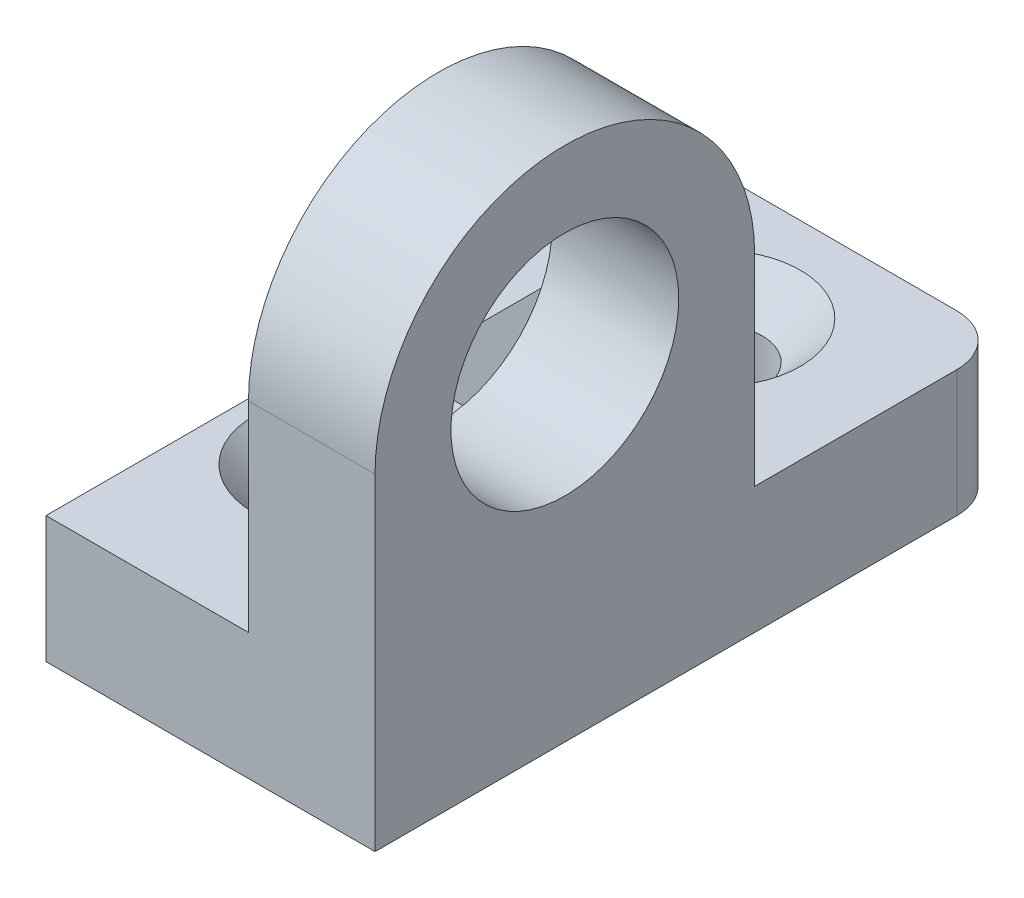
ISO-10303-21;
HEADER;
FILE_DESCRIPTION(('STEP AP214'),'2;1');
FILE_NAME('part.step','',(''),(''),'','','');
FILE_SCHEMA(('AUTOMOTIVE_DESIGN { 1 0 10303 214 1 1 1 1 }'));
ENDSEC;
DATA;
#1=APPLICATION_CONTEXT('core data for automotive mechanical design processes');
#2=APPLICATION_PROTOCOL_DEFINITION('international standard','automotive_design',2000,#1);
#3=PRODUCT_CONTEXT('',#1,'mechanical');
#4=PRODUCT('Part','Part','',(#3));
#5=PRODUCT_RELATED_PRODUCT_CATEGORY('part','',(#4));
#6=PRODUCT_DEFINITION_FORMATION('','',#4);
#7=PRODUCT_DEFINITION_CONTEXT('part definition',#1,'design');
#8=PRODUCT_DEFINITION('design','',#6,#7);
#9=PRODUCT_DEFINITION_SHAPE('','',#8);
#10=(LENGTH_UNIT() NAMED_UNIT(*) SI_UNIT(.MILLI.,.METRE.));
#11=(NAMED_UNIT(*) PLANE_ANGLE_UNIT() SI_UNIT($,.RADIAN.));
#12=(NAMED_UNIT(*) SI_UNIT($,.STERADIAN.) SOLID_ANGLE_UNIT());
#13=UNCERTAINTY_MEASURE_WITH_UNIT(LENGTH_MEASURE(1.E-05),#10,'distance_accuracy_value','');
#14=(GEOMETRIC_REPRESENTATION_CONTEXT(3) GLOBAL_UNCERTAINTY_ASSIGNED_CONTEXT((#13)) GLOBAL_UNIT_ASSIGNED_CONTEXT((#10,
#11,#12)) REPRESENTATION_CONTEXT('',''));
#15=CARTESIAN_POINT('',(0.,0.,0.));
#16=DIRECTION('',(0.,0.,1.));
#17=DIRECTION('',(1.,0.,0.));
#18=AXIS2_PLACEMENT_3D('',#15,#16,#17);
#19=CARTESIAN_POINT('',(5.,0.,0.));
#20=DIRECTION('',(1.,0.,0.));
#21=DIRECTION('',(0.,0.,-1.));
#22=AXIS2_PLACEMENT_3D('',#19,#20,#21);
#23=PLANE('',#22);
#24=CARTESIAN_POINT('',(5.,0.,0.));
#25=DIRECTION('',(1.,0.,0.));
#26=DIRECTION('',(0.,0.,-1.));
#27=AXIS2_PLACEMENT_3D('',#24,#25,#26);
#28=CIRCLE('',#27,4.50000000000002);
#29=CARTESIAN_POINT('',(5.,0.,-4.50000000000002));
#30=VERTEX_POINT('',#29);
#31=EDGE_CURVE('E173',#30,#30,#28,.T.);
#32=ORIENTED_EDGE('',*,*,#31,.F.);
#33=EDGE_LOOP('',(#32));
#34=FACE_BOUND('',#33,.T.);
#35=DIRECTION('',(0.,0.,-1.));
#36=VECTOR('',#35,1.);
#37=CARTESIAN_POINT('',(5.,-12.9200046323172,-7.5));
#38=LINE('',#37,#36);
#39=CARTESIAN_POINT('',(5.,-12.9200046323172,7.5));
#40=VERTEX_POINT('',#39);
#41=CARTESIAN_POINT('',(5.,-12.9200046323172,-15.5));
#42=VERTEX_POINT('',#41);
#43=EDGE_CURVE('E183',#40,#42,#38,.T.);
#44=ORIENTED_EDGE('',*,*,#43,.T.);
#45=DIRECTION('',(0.,-1.,0.));
#46=VECTOR('',#45,1.);
#47=CARTESIAN_POINT('',(5.,0.,-15.5));
#48=LINE('',#47,#46);
#49=CARTESIAN_POINT('',(5.,-7.92000463231724,-15.5));
#50=VERTEX_POINT('',#49);
#51=EDGE_CURVE('E53',#42,#50,#48,.F.);
#52=ORIENTED_EDGE('',*,*,#51,.T.);
#53=DIRECTION('',(0.,0.,1.));
#54=VECTOR('',#53,1.);
#55=CARTESIAN_POINT('',(5.,-7.92000463231725,7.5));
#56=LINE('',#55,#54);
#57=CARTESIAN_POINT('',(5.,-7.92000463231725,-7.5));
#58=VERTEX_POINT('',#57);
#59=EDGE_CURVE('E153',#50,#58,#56,.T.);
#60=ORIENTED_EDGE('',*,*,#59,.T.);
#61=DIRECTION('',(0.,1.,0.));
#62=VECTOR('',#61,1.);
#63=CARTESIAN_POINT('',(5.,0.,-7.5));
#64=LINE('',#63,#62);
#65=CARTESIAN_POINT('',(5.,0.,-7.5));
#66=VERTEX_POINT('',#65);
#67=EDGE_CURVE('E185',#58,#66,#64,.T.);
#68=ORIENTED_EDGE('',*,*,#67,.T.);
#69=CARTESIAN_POINT('',(5.,0.,0.));
#70=DIRECTION('',(1.,0.,0.));
#71=DIRECTION('',(0.,0.,-1.));
#72=AXIS2_PLACEMENT_3D('',#69,#70,#71);
#73=CIRCLE('',#72,7.5);
#74=CARTESIAN_POINT('',(5.,0.,7.5));
#75=VERTEX_POINT('',#74);
#76=EDGE_CURVE('E179',#66,#75,#73,.T.);
#77=ORIENTED_EDGE('',*,*,#76,.T.);
#78=DIRECTION('',(0.,-1.,0.));
#79=VECTOR('',#78,1.);
#80=CARTESIAN_POINT('',(5.,0.,7.5));
#81=LINE('',#80,#79);
#82=EDGE_CURVE('E181',#75,#40,#81,.T.);
#83=ORIENTED_EDGE('',*,*,#82,.T.);
#84=EDGE_LOOP('',(#44,#52,#60,#68,#77,#83));
#85=FACE_BOUND('',#84,.T.);
#86=ADVANCED_FACE('F45',(#34,#85),#23,.T.);
#87=CARTESIAN_POINT('',(0.,0.,0.));
#88=DIRECTION('',(1.,0.,0.));
#89=DIRECTION('',(0.,0.,-1.));
#90=AXIS2_PLACEMENT_3D('',#87,#88,#89);
#91=PLANE('',#90);
#92=DIRECTION('',(0.,1.,0.));
#93=VECTOR('',#92,1.);
#94=CARTESIAN_POINT('',(0.,0.,-7.5));
#95=LINE('',#94,#93);
#96=CARTESIAN_POINT('',(0.,-1.92000463231725,-7.5));
#97=VERTEX_POINT('',#96);
#98=CARTESIAN_POINT('',(0.,0.,-7.5));
#99=VERTEX_POINT('',#98);
#100=EDGE_CURVE('E146',#97,#99,#95,.T.);
#101=ORIENTED_EDGE('',*,*,#100,.F.);
#102=DIRECTION('',(0.,0.,-1.));
#103=VECTOR('',#102,1.);
#104=CARTESIAN_POINT('',(0.,-1.92000463231725,0.));
#105=LINE('',#104,#103);
#106=CARTESIAN_POINT('',(0.,-1.92000463231725,-4.5));
#107=VERTEX_POINT('',#106);
#108=EDGE_CURVE('E135',#97,#107,#105,.F.);
#109=ORIENTED_EDGE('',*,*,#108,.T.);
#110=DIRECTION('',(0.,1.,0.));
#111=VECTOR('',#110,1.);
#112=CARTESIAN_POINT('',(0.,0.,-4.5));
#113=LINE('',#112,#111);
#114=CARTESIAN_POINT('',(0.,-7.92000463231725,-4.5));
#115=VERTEX_POINT('',#114);
#116=EDGE_CURVE('E120',#115,#107,#113,.T.);
#117=ORIENTED_EDGE('',*,*,#116,.F.);
#118=DIRECTION('',(0.,0.,1.));
#119=VECTOR('',#118,1.);
#120=CARTESIAN_POINT('',(0.,-7.92000463231725,0.));
#121=LINE('',#120,#119);
#122=CARTESIAN_POINT('',(0.,-7.92000463231725,7.5));
#123=VERTEX_POINT('',#122);
#124=EDGE_CURVE('E168',#115,#123,#121,.T.);
#125=ORIENTED_EDGE('',*,*,#124,.T.);
#126=DIRECTION('',(0.,-1.,0.));
#127=VECTOR('',#126,1.);
#128=CARTESIAN_POINT('',(0.,0.,7.5));
#129=LINE('',#128,#127);
#130=CARTESIAN_POINT('',(0.,0.,7.5));
#131=VERTEX_POINT('',#130);
#132=EDGE_CURVE('E190',#131,#123,#129,.T.);
#133=ORIENTED_EDGE('',*,*,#132,.F.);
#134=CARTESIAN_POINT('',(0.,0.,0.));
#135=DIRECTION('',(1.,0.,0.));
#136=DIRECTION('',(0.,0.,-1.));
#137=AXIS2_PLACEMENT_3D('',#134,#135,#136);
#138=CIRCLE('',#137,7.5);
#139=EDGE_CURVE('E176',#99,#131,#138,.T.);
#140=ORIENTED_EDGE('',*,*,#139,.F.);
#141=EDGE_LOOP('',(#101,#109,#117,#125,#133,#140));
#142=FACE_BOUND('',#141,.T.);
#143=CARTESIAN_POINT('',(0.,0.,0.));
#144=DIRECTION('',(1.,0.,0.));
#145=DIRECTION('',(0.,0.,-1.));
#146=AXIS2_PLACEMENT_3D('',#143,#144,#145);
#147=CIRCLE('',#146,4.50000000000002);
#148=CARTESIAN_POINT('',(0.,0.,-4.50000000000002));
#149=VERTEX_POINT('',#148);
#150=EDGE_CURVE('E172',#149,#149,#147,.T.);
#151=ORIENTED_EDGE('',*,*,#150,.T.);
#152=EDGE_LOOP('',(#151));
#153=FACE_BOUND('',#152,.T.);
#154=ADVANCED_FACE('F142',(#142,#153),#91,.F.);
#155=CARTESIAN_POINT('',(5.,0.,0.));
#156=DIRECTION('',(-1.,0.,0.));
#157=DIRECTION('',(0.,0.,1.));
#158=AXIS2_PLACEMENT_3D('',#155,#156,#157);
#159=CYLINDRICAL_SURFACE('',#158,7.5);
#160=DIRECTION('',(-1.,0.,0.));
#161=VECTOR('',#160,1.);
#162=CARTESIAN_POINT('',(5.,0.,7.5));
#163=LINE('',#162,#161);
#164=EDGE_CURVE('E197',#75,#131,#163,.T.);
#165=ORIENTED_EDGE('',*,*,#164,.F.);
#166=ORIENTED_EDGE('',*,*,#76,.F.);
#167=DIRECTION('',(-1.,0.,0.));
#168=VECTOR('',#167,1.);
#169=CARTESIAN_POINT('',(5.,0.,-7.5));
#170=LINE('',#169,#168);
#171=EDGE_CURVE('E187',#66,#99,#170,.T.);
#172=ORIENTED_EDGE('',*,*,#171,.T.);
#173=ORIENTED_EDGE('',*,*,#139,.T.);
#174=EDGE_LOOP('',(#165,#166,#172,#173));
#175=FACE_BOUND('',#174,.T.);
#176=ADVANCED_FACE('F239',(#175),#159,.T.);
#177=CARTESIAN_POINT('',(5.,0.,7.5));
#178=DIRECTION('',(0.,0.,-1.));
#179=DIRECTION('',(0.,1.,0.));
#180=AXIS2_PLACEMENT_3D('',#177,#178,#179);
#181=PLANE('',#180);
#182=ORIENTED_EDGE('',*,*,#132,.T.);
#183=DIRECTION('',(-1.,0.,0.));
#184=VECTOR('',#183,1.);
#185=CARTESIAN_POINT('',(5.,-7.92000463231725,7.5));
#186=LINE('',#185,#184);
#187=CARTESIAN_POINT('',(-8.,-7.92000463231725,7.5));
#188=VERTEX_POINT('',#187);
#189=EDGE_CURVE('E155',#123,#188,#186,.T.);
#190=ORIENTED_EDGE('',*,*,#189,.T.);
#191=DIRECTION('',(0.,-1.,0.));
#192=VECTOR('',#191,1.);
#193=CARTESIAN_POINT('',(-8.,-7.92000463231725,7.5));
#194=LINE('',#193,#192);
#195=CARTESIAN_POINT('',(-8.,-12.9200046323172,7.5));
#196=VERTEX_POINT('',#195);
#197=EDGE_CURVE('E162',#188,#196,#194,.T.);
#198=ORIENTED_EDGE('',*,*,#197,.T.);
#199=DIRECTION('',(-1.,0.,0.));
#200=VECTOR('',#199,1.);
#201=CARTESIAN_POINT('',(5.,-12.9200046323172,7.5));
#202=LINE('',#201,#200);
#203=EDGE_CURVE('E195',#40,#196,#202,.T.);
#204=ORIENTED_EDGE('',*,*,#203,.F.);
#205=ORIENTED_EDGE('',*,*,#82,.F.);
#206=ORIENTED_EDGE('',*,*,#164,.T.);
#207=EDGE_LOOP('',(#182,#190,#198,#204,#205,#206));
#208=FACE_BOUND('',#207,.T.);
#209=ADVANCED_FACE('F251',(#208),#181,.F.);
#210=CARTESIAN_POINT('',(5.,-12.9200046323172,-7.5));
#211=DIRECTION('',(0.,1.,0.));
#212=DIRECTION('',(0.,0.,1.));
#213=AXIS2_PLACEMENT_3D('',#210,#211,#212);
#214=PLANE('',#213);
#215=CARTESIAN_POINT('',(-1.5,-12.9200046323172,-12.5));
#216=DIRECTION('',(0.,1.,0.));
#217=DIRECTION('',(0.,0.,1.));
#218=AXIS2_PLACEMENT_3D('',#215,#216,#217);
#219=CIRCLE('',#218,1.8);
#220=CARTESIAN_POINT('',(-1.5,-12.9200046323172,-10.7));
#221=VERTEX_POINT('',#220);
#222=EDGE_CURVE('E275',#221,#221,#219,.T.);
#223=ORIENTED_EDGE('',*,*,#222,.T.);
#224=EDGE_LOOP('',(#223));
#225=FACE_BOUND('',#224,.T.);
#226=CARTESIAN_POINT('',(-4.,-12.9200046323172,0.));
#227=DIRECTION('',(0.,1.,0.));
#228=DIRECTION('',(0.,0.,1.));
#229=AXIS2_PLACEMENT_3D('',#226,#227,#228);
#230=CIRCLE('',#229,1.8);
#231=CARTESIAN_POINT('',(-4.,-12.9200046323172,1.8));
#232=VERTEX_POINT('',#231);
#233=EDGE_CURVE('E139',#232,#232,#230,.T.);
#234=ORIENTED_EDGE('',*,*,#233,.T.);
#235=EDGE_LOOP('',(#234));
#236=FACE_BOUND('',#235,.T.);
#237=DIRECTION('',(1.,0.,0.));
#238=VECTOR('',#237,1.);
#239=CARTESIAN_POINT('',(5.,-12.9200046323172,-17.5));
#240=LINE('',#239,#238);
#241=CARTESIAN_POINT('',(-8.,-12.9200046323172,-17.5));
#242=VERTEX_POINT('',#241);
#243=CARTESIAN_POINT('',(3.,-12.9200046323172,-17.5));
#244=VERTEX_POINT('',#243);
#245=EDGE_CURVE('E149',#242,#244,#240,.T.);
#246=ORIENTED_EDGE('',*,*,#245,.T.);
#247=CARTESIAN_POINT('',(3.,-12.9200046323172,-15.5));
#248=DIRECTION('',(0.,1.,0.));
#249=DIRECTION('',(0.,0.,1.));
#250=AXIS2_PLACEMENT_3D('',#247,#248,#249);
#251=CIRCLE('',#250,2.);
#252=EDGE_CURVE('E67',#244,#42,#251,.F.);
#253=ORIENTED_EDGE('',*,*,#252,.T.);
#254=ORIENTED_EDGE('',*,*,#43,.F.);
#255=ORIENTED_EDGE('',*,*,#203,.T.);
#256=DIRECTION('',(0.,0.,-1.));
#257=VECTOR('',#256,1.);
#258=CARTESIAN_POINT('',(-8.,-12.9200046323172,7.5));
#259=LINE('',#258,#257);
#260=EDGE_CURVE('E147',#196,#242,#259,.T.);
#261=ORIENTED_EDGE('',*,*,#260,.T.);
#262=EDGE_LOOP('',(#246,#253,#254,#255,#261));
#263=FACE_BOUND('',#262,.T.);
#264=ADVANCED_FACE('F212',(#225,#236,#263),#214,.F.);
#265=CARTESIAN_POINT('',(5.,0.,-7.5));
#266=DIRECTION('',(0.,0.,1.));
#267=DIRECTION('',(0.,-1.,0.));
#268=AXIS2_PLACEMENT_3D('',#265,#266,#267);
#269=PLANE('',#268);
#270=DIRECTION('',(-1.,0.,0.));
#271=VECTOR('',#270,1.);
#272=CARTESIAN_POINT('',(5.,-7.92000463231725,-7.5));
#273=LINE('',#272,#271);
#274=CARTESIAN_POINT('',(-6.,-7.92000463231725,-7.5));
#275=VERTEX_POINT('',#274);
#276=EDGE_CURVE('E200',#58,#275,#273,.T.);
#277=ORIENTED_EDGE('',*,*,#276,.T.);
#278=DIRECTION('',(-0.707106781186548,-0.707106781186547,0.));
#279=VECTOR('',#278,1.);
#280=CARTESIAN_POINT('',(0.,-1.92000463231725,-7.5));
#281=LINE('',#280,#279);
#282=EDGE_CURVE('E138',#97,#275,#281,.T.);
#283=ORIENTED_EDGE('',*,*,#282,.F.);
#284=ORIENTED_EDGE('',*,*,#100,.T.);
#285=ORIENTED_EDGE('',*,*,#171,.F.);
#286=ORIENTED_EDGE('',*,*,#67,.F.);
#287=EDGE_LOOP('',(#277,#283,#284,#285,#286));
#288=FACE_BOUND('',#287,.T.);
#289=ADVANCED_FACE('F246',(#288),#269,.F.);
#290=CARTESIAN_POINT('',(5.,0.,0.));
#291=DIRECTION('',(-1.,0.,0.));
#292=DIRECTION('',(0.,0.,1.));
#293=AXIS2_PLACEMENT_3D('',#290,#291,#292);
#294=CYLINDRICAL_SURFACE('',#293,4.50000000000002);
#295=ORIENTED_EDGE('',*,*,#31,.T.);
#296=EDGE_LOOP('',(#295));
#297=FACE_BOUND('',#296,.T.);
#298=ORIENTED_EDGE('',*,*,#150,.F.);
#299=EDGE_LOOP('',(#298));
#300=FACE_BOUND('',#299,.T.);
#301=ADVANCED_FACE('F243',(#297,#300),#294,.F.);
#302=CARTESIAN_POINT('',(0.,-7.92000463231725,0.));
#303=DIRECTION('',(0.,1.,0.));
#304=DIRECTION('',(0.,0.,1.));
#305=AXIS2_PLACEMENT_3D('',#302,#303,#304);
#306=PLANE('',#305);
#307=CARTESIAN_POINT('',(-1.5,-7.92000463231725,-12.5));
#308=DIRECTION('',(0.,1.,0.));
#309=DIRECTION('',(0.,0.,1.));
#310=AXIS2_PLACEMENT_3D('',#307,#308,#309);
#311=CIRCLE('',#310,3.3);
#312=CARTESIAN_POINT('',(-1.5,-7.92000463231725,-9.2));
#313=VERTEX_POINT('',#312);
#314=EDGE_CURVE('E281',#313,#313,#311,.T.);
#315=ORIENTED_EDGE('',*,*,#314,.F.);
#316=EDGE_LOOP('',(#315));
#317=FACE_BOUND('',#316,.T.);
#318=CARTESIAN_POINT('',(-4.,-7.92000463231725,0.));
#319=DIRECTION('',(0.,1.,0.));
#320=DIRECTION('',(0.,0.,1.));
#321=AXIS2_PLACEMENT_3D('',#318,#319,#320);
#322=CIRCLE('',#321,3.3);
#323=CARTESIAN_POINT('',(-4.,-7.92000463231725,3.3));
#324=VERTEX_POINT('',#323);
#325=EDGE_CURVE('E272',#324,#324,#322,.T.);
#326=ORIENTED_EDGE('',*,*,#325,.F.);
#327=EDGE_LOOP('',(#326));
#328=FACE_BOUND('',#327,.T.);
#329=ORIENTED_EDGE('',*,*,#59,.F.);
#330=CARTESIAN_POINT('',(3.,-7.92000463231724,-15.5));
#331=DIRECTION('',(0.,1.,0.));
#332=DIRECTION('',(0.,0.,1.));
#333=AXIS2_PLACEMENT_3D('',#330,#331,#332);
#334=CIRCLE('',#333,2.);
#335=CARTESIAN_POINT('',(3.,-7.92000463231725,-17.5));
#336=VERTEX_POINT('',#335);
#337=EDGE_CURVE('E13',#50,#336,#334,.T.);
#338=ORIENTED_EDGE('',*,*,#337,.T.);
#339=DIRECTION('',(1.,0.,0.));
#340=VECTOR('',#339,1.);
#341=CARTESIAN_POINT('',(5.,-7.92000463231725,-17.5));
#342=LINE('',#341,#340);
#343=CARTESIAN_POINT('',(-8.,-7.92000463231725,-17.5));
#344=VERTEX_POINT('',#343);
#345=EDGE_CURVE('E160',#344,#336,#342,.T.);
#346=ORIENTED_EDGE('',*,*,#345,.F.);
#347=DIRECTION('',(0.,0.,-1.));
#348=VECTOR('',#347,1.);
#349=CARTESIAN_POINT('',(-8.,-7.92000463231725,7.5));
#350=LINE('',#349,#348);
#351=EDGE_CURVE('E157',#188,#344,#350,.T.);
#352=ORIENTED_EDGE('',*,*,#351,.F.);
#353=ORIENTED_EDGE('',*,*,#189,.F.);
#354=ORIENTED_EDGE('',*,*,#124,.F.);
#355=DIRECTION('',(-1.,0.,0.));
#356=VECTOR('',#355,1.);
#357=CARTESIAN_POINT('',(0.,-7.92000463231725,-4.5));
#358=LINE('',#357,#356);
#359=CARTESIAN_POINT('',(-6.,-7.92000463231725,-4.5));
#360=VERTEX_POINT('',#359);
#361=EDGE_CURVE('E126',#115,#360,#358,.T.);
#362=ORIENTED_EDGE('',*,*,#361,.T.);
#363=DIRECTION('',(0.,0.,-1.));
#364=VECTOR('',#363,1.);
#365=CARTESIAN_POINT('',(-6.,-7.92000463231725,0.));
#366=LINE('',#365,#364);
#367=EDGE_CURVE('E130',#275,#360,#366,.F.);
#368=ORIENTED_EDGE('',*,*,#367,.F.);
#369=ORIENTED_EDGE('',*,*,#276,.F.);
#370=EDGE_LOOP('',(#329,#338,#346,#352,#353,#354,#362,#368,#369));
#371=FACE_BOUND('',#370,.T.);
#372=ADVANCED_FACE('F221',(#317,#328,#371),#306,.T.);
#373=CARTESIAN_POINT('',(5.,-7.92000463231725,-17.5));
#374=DIRECTION('',(0.,0.,-1.));
#375=DIRECTION('',(-1.,0.,0.));
#376=AXIS2_PLACEMENT_3D('',#373,#374,#375);
#377=PLANE('',#376);
#378=ORIENTED_EDGE('',*,*,#345,.T.);
#379=DIRECTION('',(0.,-1.,0.));
#380=VECTOR('',#379,1.);
#381=CARTESIAN_POINT('',(3.,-7.92000463231725,-17.5));
#382=LINE('',#381,#380);
#383=EDGE_CURVE('E202',#336,#244,#382,.T.);
#384=ORIENTED_EDGE('',*,*,#383,.T.);
#385=ORIENTED_EDGE('',*,*,#245,.F.);
#386=DIRECTION('',(0.,-1.,0.));
#387=VECTOR('',#386,1.);
#388=CARTESIAN_POINT('',(-8.,-7.92000463231725,-17.5));
#389=LINE('',#388,#387);
#390=EDGE_CURVE('E165',#344,#242,#389,.T.);
#391=ORIENTED_EDGE('',*,*,#390,.F.);
#392=EDGE_LOOP('',(#378,#384,#385,#391));
#393=FACE_BOUND('',#392,.T.);
#394=ADVANCED_FACE('F208',(#393),#377,.T.);
#395=CARTESIAN_POINT('',(-8.,-7.92000463231725,7.5));
#396=DIRECTION('',(-1.,0.,0.));
#397=DIRECTION('',(0.,0.,1.));
#398=AXIS2_PLACEMENT_3D('',#395,#396,#397);
#399=PLANE('',#398);
#400=ORIENTED_EDGE('',*,*,#390,.T.);
#401=ORIENTED_EDGE('',*,*,#260,.F.);
#402=ORIENTED_EDGE('',*,*,#197,.F.);
#403=ORIENTED_EDGE('',*,*,#351,.T.);
#404=EDGE_LOOP('',(#400,#401,#402,#403));
#405=FACE_BOUND('',#404,.T.);
#406=ADVANCED_FACE('F217',(#405),#399,.T.);
#407=CARTESIAN_POINT('',(0.,-1.92000463231725,-7.5));
#408=DIRECTION('',(0.707106781186547,-0.707106781186548,0.));
#409=DIRECTION('',(-0.707106781186548,-0.707106781186547,0.));
#410=AXIS2_PLACEMENT_3D('',#407,#408,#409);
#411=PLANE('',#410);
#412=ORIENTED_EDGE('',*,*,#108,.F.);
#413=ORIENTED_EDGE('',*,*,#282,.T.);
#414=ORIENTED_EDGE('',*,*,#367,.T.);
#415=DIRECTION('',(-0.707106781186548,-0.707106781186547,0.));
#416=VECTOR('',#415,1.);
#417=CARTESIAN_POINT('',(0.,-1.92000463231725,-4.5));
#418=LINE('',#417,#416);
#419=EDGE_CURVE('E123',#107,#360,#418,.T.);
#420=ORIENTED_EDGE('',*,*,#419,.F.);
#421=EDGE_LOOP('',(#412,#413,#414,#420));
#422=FACE_BOUND('',#421,.T.);
#423=ADVANCED_FACE('F133',(#422),#411,.F.);
#424=CARTESIAN_POINT('',(-1.5,-2.71000231615862,-4.5));
#425=DIRECTION('',(0.,0.,-1.));
#426=DIRECTION('',(0.,1.,0.));
#427=AXIS2_PLACEMENT_3D('',#424,#425,#426);
#428=PLANE('',#427);
#429=ORIENTED_EDGE('',*,*,#361,.F.);
#430=ORIENTED_EDGE('',*,*,#116,.T.);
#431=ORIENTED_EDGE('',*,*,#419,.T.);
#432=EDGE_LOOP('',(#429,#430,#431));
#433=FACE_BOUND('',#432,.T.);
#434=ADVANCED_FACE('F122',(#433),#428,.F.);
#435=CARTESIAN_POINT('',(-4.,-7.92000463231725,0.));
#436=DIRECTION('',(0.,1.,0.));
#437=DIRECTION('',(0.,0.,1.));
#438=AXIS2_PLACEMENT_3D('',#435,#436,#437);
#439=CYLINDRICAL_SURFACE('',#438,1.8);
#440=ORIENTED_EDGE('',*,*,#233,.F.);
#441=EDGE_LOOP('',(#440));
#442=FACE_BOUND('',#441,.T.);
#443=CARTESIAN_POINT('',(-4.,-9.42000463231725,0.));
#444=DIRECTION('',(0.,1.,0.));
#445=DIRECTION('',(0.,0.,1.));
#446=AXIS2_PLACEMENT_3D('',#443,#444,#445);
#447=CIRCLE('',#446,1.8);
#448=CARTESIAN_POINT('',(-4.,-9.42000463231725,1.8));
#449=VERTEX_POINT('',#448);
#450=EDGE_CURVE('E269',#449,#449,#447,.T.);
#451=ORIENTED_EDGE('',*,*,#450,.T.);
#452=EDGE_LOOP('',(#451));
#453=FACE_BOUND('',#452,.T.);
#454=ADVANCED_FACE('F293',(#442,#453),#439,.F.);
#455=CARTESIAN_POINT('',(-4.,-7.92000463231725,0.));
#456=DIRECTION('',(0.,1.,0.));
#457=DIRECTION('',(0.,0.,1.));
#458=AXIS2_PLACEMENT_3D('',#455,#456,#457);
#459=CONICAL_SURFACE('',#458,3.3,0.785398163397448);
#460=ORIENTED_EDGE('',*,*,#450,.F.);
#461=EDGE_LOOP('',(#460));
#462=FACE_BOUND('',#461,.T.);
#463=ORIENTED_EDGE('',*,*,#325,.T.);
#464=EDGE_LOOP('',(#463));
#465=FACE_BOUND('',#464,.T.);
#466=ADVANCED_FACE('F291',(#462,#465),#459,.F.);
#467=CARTESIAN_POINT('',(-1.5,-7.92000463231725,-12.5));
#468=DIRECTION('',(0.,1.,0.));
#469=DIRECTION('',(0.,0.,1.));
#470=AXIS2_PLACEMENT_3D('',#467,#468,#469);
#471=CYLINDRICAL_SURFACE('',#470,1.8);
#472=ORIENTED_EDGE('',*,*,#222,.F.);
#473=EDGE_LOOP('',(#472));
#474=FACE_BOUND('',#473,.T.);
#475=CARTESIAN_POINT('',(-1.5,-9.42000463231725,-12.5));
#476=DIRECTION('',(0.,1.,0.));
#477=DIRECTION('',(0.,0.,1.));
#478=AXIS2_PLACEMENT_3D('',#475,#476,#477);
#479=CIRCLE('',#478,1.8);
#480=CARTESIAN_POINT('',(-1.5,-9.42000463231725,-10.7));
#481=VERTEX_POINT('',#480);
#482=EDGE_CURVE('E278',#481,#481,#479,.T.);
#483=ORIENTED_EDGE('',*,*,#482,.T.);
#484=EDGE_LOOP('',(#483));
#485=FACE_BOUND('',#484,.T.);
#486=ADVANCED_FACE('F228',(#474,#485),#471,.F.);
#487=CARTESIAN_POINT('',(-1.5,-7.92000463231725,-12.5));
#488=DIRECTION('',(0.,1.,0.));
#489=DIRECTION('',(0.,0.,1.));
#490=AXIS2_PLACEMENT_3D('',#487,#488,#489);
#491=CONICAL_SURFACE('',#490,3.3,0.785398163397448);
#492=ORIENTED_EDGE('',*,*,#482,.F.);
#493=EDGE_LOOP('',(#492));
#494=FACE_BOUND('',#493,.T.);
#495=ORIENTED_EDGE('',*,*,#314,.T.);
#496=EDGE_LOOP('',(#495));
#497=FACE_BOUND('',#496,.T.);
#498=ADVANCED_FACE('F224',(#494,#497),#491,.F.);
#499=CARTESIAN_POINT('',(3.,-7.92000463231725,-15.5));
#500=DIRECTION('',(0.,-1.,0.));
#501=DIRECTION('',(0.,0.,-1.));
#502=AXIS2_PLACEMENT_3D('',#499,#500,#501);
#503=CYLINDRICAL_SURFACE('',#502,2.);
#504=ORIENTED_EDGE('',*,*,#337,.F.);
#505=ORIENTED_EDGE('',*,*,#51,.F.);
#506=ORIENTED_EDGE('',*,*,#252,.F.);
#507=ORIENTED_EDGE('',*,*,#383,.F.);
#508=EDGE_LOOP('',(#504,#505,#506,#507));
#509=FACE_BOUND('',#508,.T.);
#510=ADVANCED_FACE('F47',(#509),#503,.T.);
#511=CLOSED_SHELL('',(#86,#154,#176,#209,#264,#289,#301,#372,#394,#406,#423,#434,#454,#466,#486,
#498,#510));
#512=MANIFOLD_SOLID_BREP('B2',#511);
#513=ADVANCED_BREP_SHAPE_REPRESENTATION('',(#18,#512),#14);
#514=SHAPE_DEFINITION_REPRESENTATION(#9,#513);
ENDSEC;
END-ISO-10303-21;
